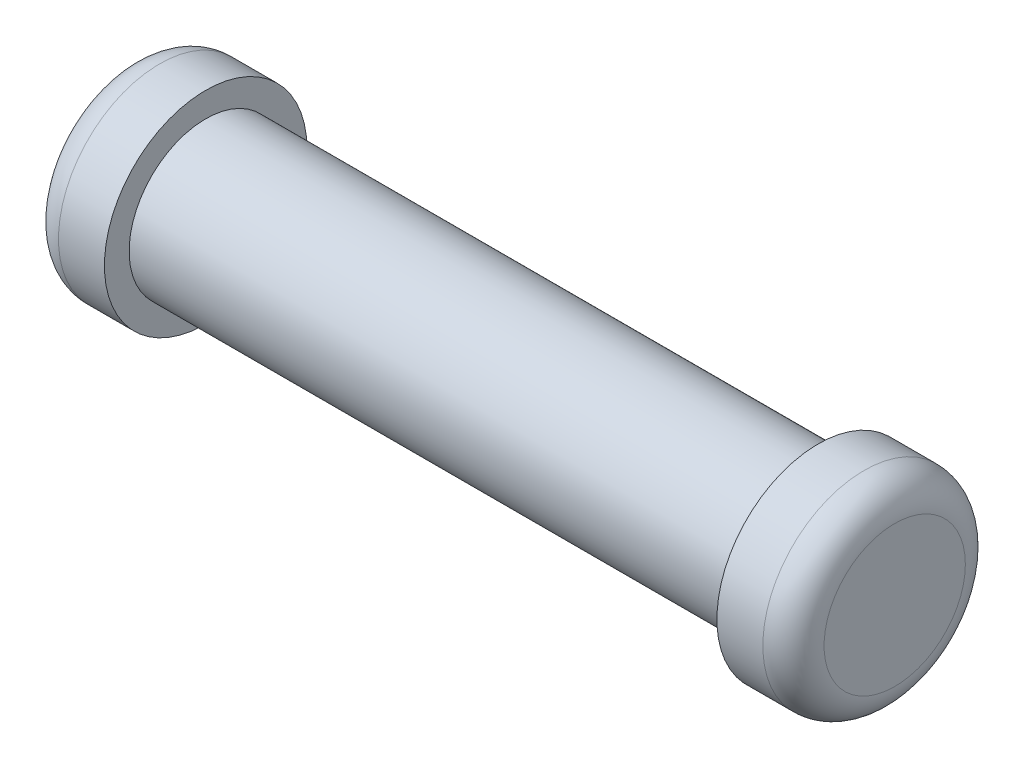
ISO-10303-21;
HEADER;
FILE_DESCRIPTION(('STEP AP214'),'2;1');
FILE_NAME('part.step','',(''),(''),'','','');
FILE_SCHEMA(('AUTOMOTIVE_DESIGN { 1 0 10303 214 1 1 1 1 }'));
ENDSEC;
DATA;
#1=APPLICATION_CONTEXT('core data for automotive mechanical design processes');
#2=APPLICATION_PROTOCOL_DEFINITION('international standard','automotive_design',2000,#1);
#3=PRODUCT_CONTEXT('',#1,'mechanical');
#4=PRODUCT('Part','Part','',(#3));
#5=PRODUCT_RELATED_PRODUCT_CATEGORY('part','',(#4));
#6=PRODUCT_DEFINITION_FORMATION('','',#4);
#7=PRODUCT_DEFINITION_CONTEXT('part definition',#1,'design');
#8=PRODUCT_DEFINITION('design','',#6,#7);
#9=PRODUCT_DEFINITION_SHAPE('','',#8);
#10=(LENGTH_UNIT() NAMED_UNIT(*) SI_UNIT(.MILLI.,.METRE.));
#11=(NAMED_UNIT(*) PLANE_ANGLE_UNIT() SI_UNIT($,.RADIAN.));
#12=(NAMED_UNIT(*) SI_UNIT($,.STERADIAN.) SOLID_ANGLE_UNIT());
#13=UNCERTAINTY_MEASURE_WITH_UNIT(LENGTH_MEASURE(1.E-05),#10,'distance_accuracy_value','');
#14=(GEOMETRIC_REPRESENTATION_CONTEXT(3) GLOBAL_UNCERTAINTY_ASSIGNED_CONTEXT((#13)) GLOBAL_UNIT_ASSIGNED_CONTEXT((#10,
#11,#12)) REPRESENTATION_CONTEXT('',''));
#15=CARTESIAN_POINT('',(0.,0.,0.));
#16=DIRECTION('',(0.,0.,1.));
#17=DIRECTION('',(1.,0.,0.));
#18=AXIS2_PLACEMENT_3D('',#15,#16,#17);
#19=CARTESIAN_POINT('',(-100.78064516129,0.,33.5935483870968));
#20=DIRECTION('',(-1.,0.,0.));
#21=DIRECTION('',(0.,0.,1.));
#22=AXIS2_PLACEMENT_3D('',#19,#20,#21);
#23=PLANE('',#22);
#24=CARTESIAN_POINT('',(-100.78064516129,0.,0.));
#25=DIRECTION('',(1.,0.,0.));
#26=DIRECTION('',(0.,0.,-1.));
#27=AXIS2_PLACEMENT_3D('',#24,#25,#26);
#28=CIRCLE('',#27,25.4);
#29=CARTESIAN_POINT('',(-100.78064516129,0.,-25.4));
#30=VERTEX_POINT('',#29);
#31=EDGE_CURVE('E72',#30,#30,#28,.T.);
#32=ORIENTED_EDGE('',*,*,#31,.F.);
#33=EDGE_LOOP('',(#32));
#34=FACE_BOUND('',#33,.T.);
#35=CARTESIAN_POINT('',(-100.78064516129,0.,0.));
#36=DIRECTION('',(1.,0.,0.));
#37=DIRECTION('',(0.,0.,-1.));
#38=AXIS2_PLACEMENT_3D('',#35,#36,#37);
#39=CIRCLE('',#38,33.5935483870968);
#40=CARTESIAN_POINT('',(-100.78064516129,0.,-33.5935483870968));
#41=VERTEX_POINT('',#40);
#42=EDGE_CURVE('E10',#41,#41,#39,.T.);
#43=ORIENTED_EDGE('',*,*,#42,.T.);
#44=EDGE_LOOP('',(#43));
#45=FACE_BOUND('',#44,.T.);
#46=ADVANCED_FACE('F37',(#34,#45),#23,.F.);
#47=CARTESIAN_POINT('',(127.81935483871,0.,0.));
#48=DIRECTION('',(1.,0.,0.));
#49=DIRECTION('',(0.,0.,-1.));
#50=AXIS2_PLACEMENT_3D('',#47,#48,#49);
#51=CYLINDRICAL_SURFACE('',#50,33.5935483870968);
#52=ORIENTED_EDGE('',*,*,#42,.F.);
#53=EDGE_LOOP('',(#52));
#54=FACE_BOUND('',#53,.T.);
#55=CARTESIAN_POINT('',(-116.02064516129,0.,0.));
#56=DIRECTION('',(1.,0.,0.));
#57=DIRECTION('',(0.,0.,-1.));
#58=AXIS2_PLACEMENT_3D('',#55,#56,#57);
#59=CIRCLE('',#58,33.5935483870968);
#60=CARTESIAN_POINT('',(-116.02064516129,0.,-33.5935483870968));
#61=VERTEX_POINT('',#60);
#62=EDGE_CURVE('E44',#61,#61,#59,.T.);
#63=ORIENTED_EDGE('',*,*,#62,.T.);
#64=EDGE_LOOP('',(#63));
#65=FACE_BOUND('',#64,.T.);
#66=ADVANCED_FACE('F80',(#54,#65),#51,.T.);
#67=CARTESIAN_POINT('',(-116.02064516129,0.,0.));
#68=DIRECTION('',(1.,0.,0.));
#69=DIRECTION('',(0.,0.,-1.));
#70=AXIS2_PLACEMENT_3D('',#67,#68,#69);
#71=TOROIDAL_SURFACE('',#70,23.4335483870968,10.16);
#72=ORIENTED_EDGE('',*,*,#62,.F.);
#73=EDGE_LOOP('',(#72));
#74=FACE_BOUND('',#73,.T.);
#75=CARTESIAN_POINT('',(-126.18064516129,0.,0.));
#76=DIRECTION('',(1.,0.,0.));
#77=DIRECTION('',(0.,0.,-1.));
#78=AXIS2_PLACEMENT_3D('',#75,#76,#77);
#79=CIRCLE('',#78,23.4335483870967);
#80=CARTESIAN_POINT('',(-126.18064516129,0.,-23.4335483870967));
#81=VERTEX_POINT('',#80);
#82=EDGE_CURVE('E49',#81,#81,#79,.T.);
#83=ORIENTED_EDGE('',*,*,#82,.T.);
#84=EDGE_LOOP('',(#83));
#85=FACE_BOUND('',#84,.T.);
#86=ADVANCED_FACE('F84',(#74,#85),#71,.T.);
#87=CARTESIAN_POINT('',(-126.18064516129,0.,0.));
#88=DIRECTION('',(1.,0.,0.));
#89=DIRECTION('',(0.,0.,-1.));
#90=AXIS2_PLACEMENT_3D('',#87,#88,#89);
#91=PLANE('',#90);
#92=ORIENTED_EDGE('',*,*,#82,.F.);
#93=EDGE_LOOP('',(#92));
#94=FACE_BOUND('',#93,.T.);
#95=ADVANCED_FACE('F89',(#94),#91,.F.);
#96=CARTESIAN_POINT('',(127.81935483871,0.,23.4335483870967));
#97=DIRECTION('',(-1.,0.,0.));
#98=DIRECTION('',(0.,0.,1.));
#99=AXIS2_PLACEMENT_3D('',#96,#97,#98);
#100=PLANE('',#99);
#101=CARTESIAN_POINT('',(127.81935483871,0.,0.));
#102=DIRECTION('',(1.,0.,0.));
#103=DIRECTION('',(0.,0.,-1.));
#104=AXIS2_PLACEMENT_3D('',#101,#102,#103);
#105=CIRCLE('',#104,23.4335483870967);
#106=CARTESIAN_POINT('',(127.81935483871,0.,-23.4335483870967));
#107=VERTEX_POINT('',#106);
#108=EDGE_CURVE('E54',#107,#107,#105,.T.);
#109=ORIENTED_EDGE('',*,*,#108,.T.);
#110=EDGE_LOOP('',(#109));
#111=FACE_BOUND('',#110,.T.);
#112=ADVANCED_FACE('F95',(#111),#100,.F.);
#113=CARTESIAN_POINT('',(117.65935483871,0.,0.));
#114=DIRECTION('',(1.,0.,0.));
#115=DIRECTION('',(0.,0.,-1.));
#116=AXIS2_PLACEMENT_3D('',#113,#114,#115);
#117=TOROIDAL_SURFACE('',#116,23.4335483870968,10.16);
#118=ORIENTED_EDGE('',*,*,#108,.F.);
#119=EDGE_LOOP('',(#118));
#120=FACE_BOUND('',#119,.T.);
#121=CARTESIAN_POINT('',(117.65935483871,0.,0.));
#122=DIRECTION('',(1.,0.,0.));
#123=DIRECTION('',(0.,0.,-1.));
#124=AXIS2_PLACEMENT_3D('',#121,#122,#123);
#125=CIRCLE('',#124,33.5935483870968);
#126=CARTESIAN_POINT('',(117.65935483871,0.,-33.5935483870968));
#127=VERTEX_POINT('',#126);
#128=EDGE_CURVE('E60',#127,#127,#125,.T.);
#129=ORIENTED_EDGE('',*,*,#128,.T.);
#130=EDGE_LOOP('',(#129));
#131=FACE_BOUND('',#130,.T.);
#132=ADVANCED_FACE('F99',(#120,#131),#117,.T.);
#133=CARTESIAN_POINT('',(127.81935483871,0.,0.));
#134=DIRECTION('',(1.,0.,0.));
#135=DIRECTION('',(0.,0.,-1.));
#136=AXIS2_PLACEMENT_3D('',#133,#134,#135);
#137=CYLINDRICAL_SURFACE('',#136,33.5935483870968);
#138=ORIENTED_EDGE('',*,*,#128,.F.);
#139=EDGE_LOOP('',(#138));
#140=FACE_BOUND('',#139,.T.);
#141=CARTESIAN_POINT('',(102.41935483871,0.,0.));
#142=DIRECTION('',(1.,0.,0.));
#143=DIRECTION('',(0.,0.,-1.));
#144=AXIS2_PLACEMENT_3D('',#141,#142,#143);
#145=CIRCLE('',#144,33.5935483870968);
#146=CARTESIAN_POINT('',(102.41935483871,0.,-33.5935483870968));
#147=VERTEX_POINT('',#146);
#148=EDGE_CURVE('E64',#147,#147,#145,.T.);
#149=ORIENTED_EDGE('',*,*,#148,.T.);
#150=EDGE_LOOP('',(#149));
#151=FACE_BOUND('',#150,.T.);
#152=ADVANCED_FACE('F103',(#140,#151),#137,.T.);
#153=CARTESIAN_POINT('',(102.41935483871,0.,25.4));
#154=DIRECTION('',(1.,0.,0.));
#155=DIRECTION('',(0.,0.,-1.));
#156=AXIS2_PLACEMENT_3D('',#153,#154,#155);
#157=PLANE('',#156);
#158=ORIENTED_EDGE('',*,*,#148,.F.);
#159=EDGE_LOOP('',(#158));
#160=FACE_BOUND('',#159,.T.);
#161=CARTESIAN_POINT('',(102.41935483871,0.,0.));
#162=DIRECTION('',(1.,0.,0.));
#163=DIRECTION('',(0.,0.,-1.));
#164=AXIS2_PLACEMENT_3D('',#161,#162,#163);
#165=CIRCLE('',#164,25.4);
#166=CARTESIAN_POINT('',(102.41935483871,0.,-25.4));
#167=VERTEX_POINT('',#166);
#168=EDGE_CURVE('E68',#167,#167,#165,.T.);
#169=ORIENTED_EDGE('',*,*,#168,.T.);
#170=EDGE_LOOP('',(#169));
#171=FACE_BOUND('',#170,.T.);
#172=ADVANCED_FACE('F107',(#160,#171),#157,.F.);
#173=CARTESIAN_POINT('',(127.81935483871,0.,0.));
#174=DIRECTION('',(1.,0.,0.));
#175=DIRECTION('',(0.,0.,-1.));
#176=AXIS2_PLACEMENT_3D('',#173,#174,#175);
#177=CYLINDRICAL_SURFACE('',#176,25.4);
#178=ORIENTED_EDGE('',*,*,#168,.F.);
#179=EDGE_LOOP('',(#178));
#180=FACE_BOUND('',#179,.T.);
#181=ORIENTED_EDGE('',*,*,#31,.T.);
#182=EDGE_LOOP('',(#181));
#183=FACE_BOUND('',#182,.T.);
#184=ADVANCED_FACE('F77',(#180,#183),#177,.T.);
#185=CLOSED_SHELL('',(#46,#66,#86,#95,#112,#132,#152,#172,#184));
#186=MANIFOLD_SOLID_BREP('B2',#185);
#187=ADVANCED_BREP_SHAPE_REPRESENTATION('',(#18,#186),#14);
#188=SHAPE_DEFINITION_REPRESENTATION(#9,#187);
ENDSEC;
END-ISO-10303-21;
